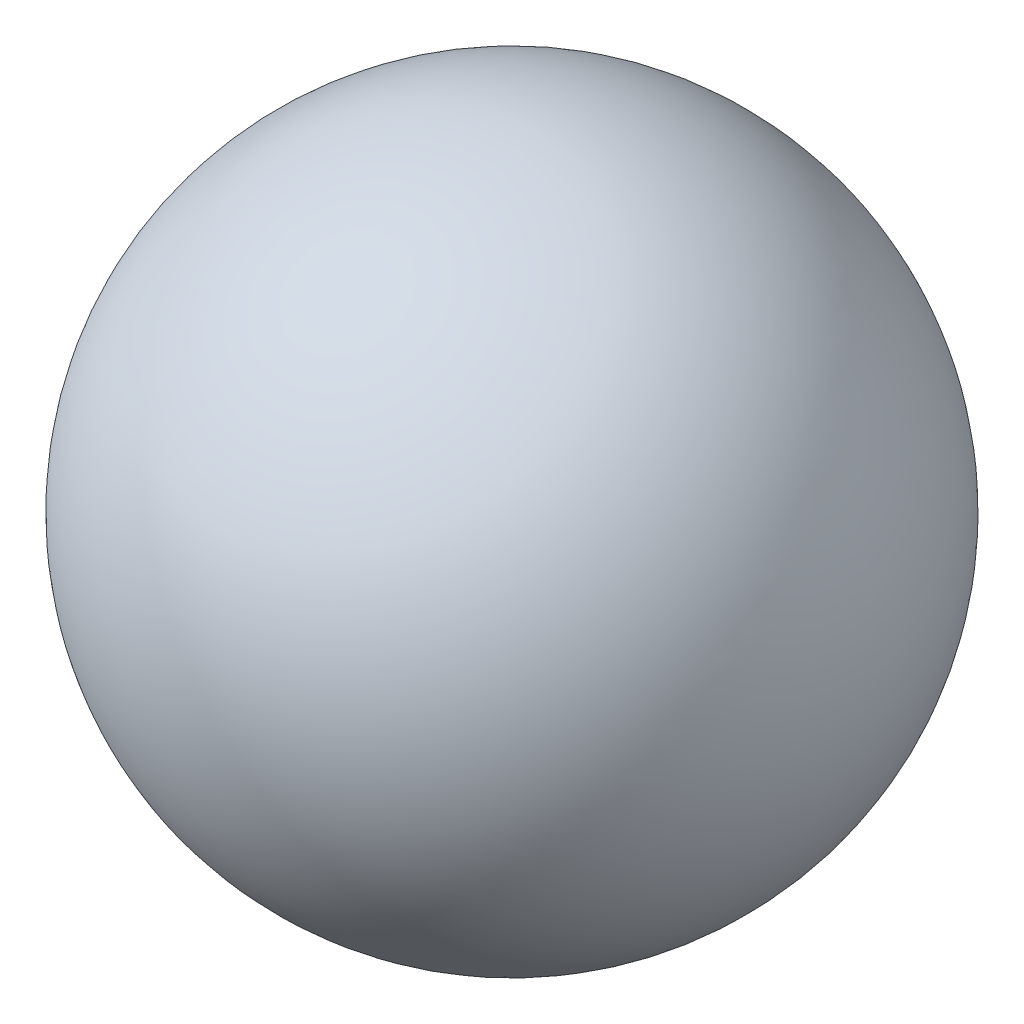
ISO-10303-21;
HEADER;
FILE_DESCRIPTION(('STEP AP214'),'2;1');
FILE_NAME('part.step','',(''),(''),'','','');
FILE_SCHEMA(('AUTOMOTIVE_DESIGN { 1 0 10303 214 1 1 1 1 }'));
ENDSEC;
DATA;
#1=APPLICATION_CONTEXT('core data for automotive mechanical design processes');
#2=APPLICATION_PROTOCOL_DEFINITION('international standard','automotive_design',2000,#1);
#3=PRODUCT_CONTEXT('',#1,'mechanical');
#4=PRODUCT('Part','Part','',(#3));
#5=PRODUCT_RELATED_PRODUCT_CATEGORY('part','',(#4));
#6=PRODUCT_DEFINITION_FORMATION('','',#4);
#7=PRODUCT_DEFINITION_CONTEXT('part definition',#1,'design');
#8=PRODUCT_DEFINITION('design','',#6,#7);
#9=PRODUCT_DEFINITION_SHAPE('','',#8);
#10=(LENGTH_UNIT() NAMED_UNIT(*) SI_UNIT(.MILLI.,.METRE.));
#11=(NAMED_UNIT(*) PLANE_ANGLE_UNIT() SI_UNIT($,.RADIAN.));
#12=(NAMED_UNIT(*) SI_UNIT($,.STERADIAN.) SOLID_ANGLE_UNIT());
#13=UNCERTAINTY_MEASURE_WITH_UNIT(LENGTH_MEASURE(1.E-05),#10,'distance_accuracy_value','');
#14=(GEOMETRIC_REPRESENTATION_CONTEXT(3) GLOBAL_UNCERTAINTY_ASSIGNED_CONTEXT((#13)) GLOBAL_UNIT_ASSIGNED_CONTEXT((#10,
#11,#12)) REPRESENTATION_CONTEXT('',''));
#15=CARTESIAN_POINT('',(0.,0.,0.));
#16=DIRECTION('',(0.,0.,1.));
#17=DIRECTION('',(1.,0.,0.));
#18=AXIS2_PLACEMENT_3D('',#15,#16,#17);
#19=CARTESIAN_POINT('',(0.,0.,0.));
#20=DIRECTION('',(0.,0.,-1.));
#21=DIRECTION('',(1.,0.,0.));
#22=AXIS2_PLACEMENT_3D('',#19,#20,#21);
#23=SPHERICAL_SURFACE('',#22,113.);
#24=CARTESIAN_POINT('',(0.,0.,-113.));
#25=VERTEX_POINT('',#24);
#26=VERTEX_LOOP('',#25);
#27=FACE_BOUND('',#26,.T.);
#28=ADVANCED_FACE('F35',(#27),#23,.T.);
#29=CLOSED_SHELL('',(#28));
#30=MANIFOLD_SOLID_BREP('B2',#29);
#31=ADVANCED_BREP_SHAPE_REPRESENTATION('',(#18,#30),#14);
#32=SHAPE_DEFINITION_REPRESENTATION(#9,#31);
ENDSEC;
END-ISO-10303-21;
